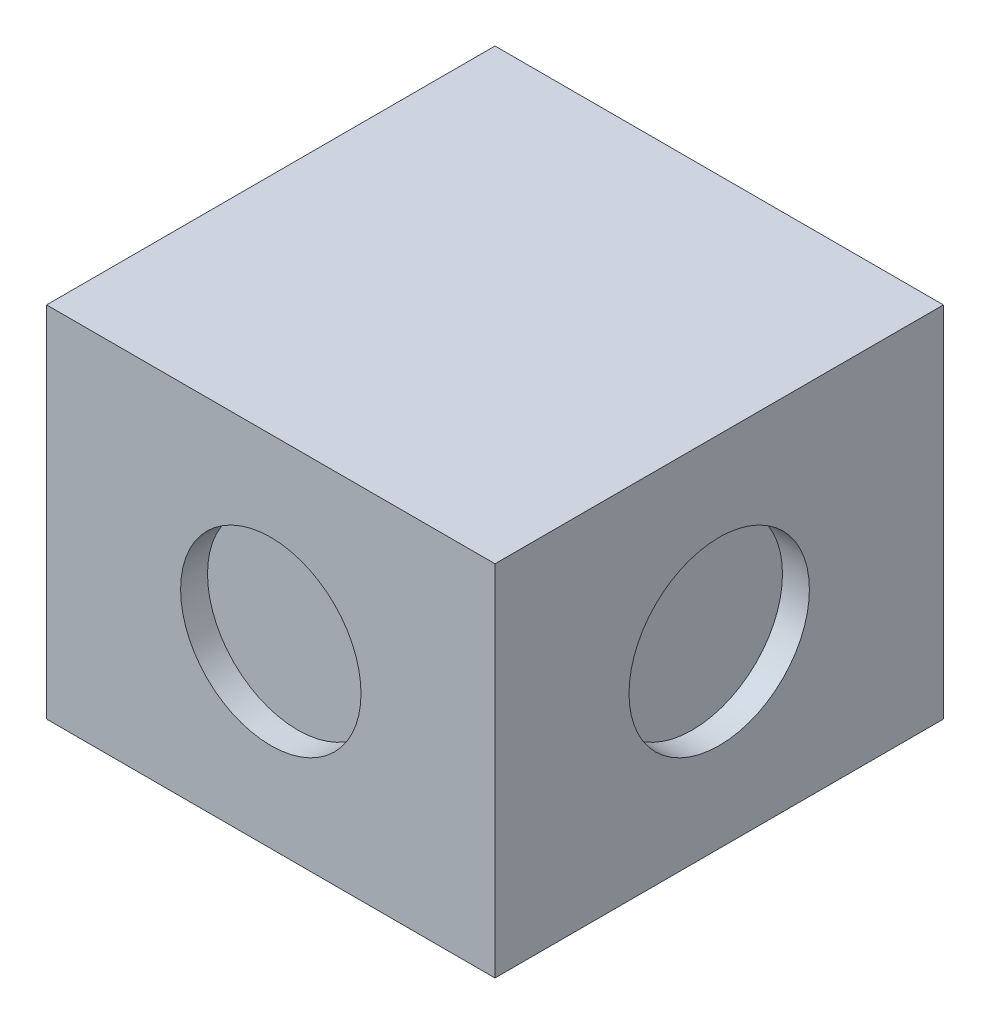
ISO-10303-21;
HEADER;
FILE_DESCRIPTION(('STEP AP214'),'2;1');
FILE_NAME('part.step','',(''),(''),'','','');
FILE_SCHEMA(('AUTOMOTIVE_DESIGN { 1 0 10303 214 1 1 1 1 }'));
ENDSEC;
DATA;
#1=APPLICATION_CONTEXT('core data for automotive mechanical design processes');
#2=APPLICATION_PROTOCOL_DEFINITION('international standard','automotive_design',2000,#1);
#3=PRODUCT_CONTEXT('',#1,'mechanical');
#4=PRODUCT('Part','Part','',(#3));
#5=PRODUCT_RELATED_PRODUCT_CATEGORY('part','',(#4));
#6=PRODUCT_DEFINITION_FORMATION('','',#4);
#7=PRODUCT_DEFINITION_CONTEXT('part definition',#1,'design');
#8=PRODUCT_DEFINITION('design','',#6,#7);
#9=PRODUCT_DEFINITION_SHAPE('','',#8);
#10=(LENGTH_UNIT() NAMED_UNIT(*) SI_UNIT(.MILLI.,.METRE.));
#11=(NAMED_UNIT(*) PLANE_ANGLE_UNIT() SI_UNIT($,.RADIAN.));
#12=(NAMED_UNIT(*) SI_UNIT($,.STERADIAN.) SOLID_ANGLE_UNIT());
#13=UNCERTAINTY_MEASURE_WITH_UNIT(LENGTH_MEASURE(1.E-05),#10,'distance_accuracy_value','');
#14=(GEOMETRIC_REPRESENTATION_CONTEXT(3) GLOBAL_UNCERTAINTY_ASSIGNED_CONTEXT((#13)) GLOBAL_UNIT_ASSIGNED_CONTEXT((#10,
#11,#12)) REPRESENTATION_CONTEXT('',''));
#15=CARTESIAN_POINT('',(0.,0.,0.));
#16=DIRECTION('',(0.,0.,1.));
#17=DIRECTION('',(1.,0.,0.));
#18=AXIS2_PLACEMENT_3D('',#15,#16,#17);
#19=CARTESIAN_POINT('',(25.,40.,25.));
#20=DIRECTION('',(-1.,0.,0.));
#21=DIRECTION('',(0.,0.,1.));
#22=AXIS2_PLACEMENT_3D('',#19,#20,#21);
#23=PLANE('',#22);
#24=CARTESIAN_POINT('',(25.,20.,0.));
#25=DIRECTION('',(1.,0.,0.));
#26=DIRECTION('',(0.,0.,-1.));
#27=AXIS2_PLACEMENT_3D('',#24,#25,#26);
#28=CIRCLE('',#27,10.057084534);
#29=CARTESIAN_POINT('',(25.,20.,-10.057084534));
#30=VERTEX_POINT('',#29);
#31=EDGE_CURVE('E114',#30,#30,#28,.T.);
#32=ORIENTED_EDGE('',*,*,#31,.F.);
#33=EDGE_LOOP('',(#32));
#34=FACE_BOUND('',#33,.T.);
#35=DIRECTION('',(0.,0.,-1.));
#36=VECTOR('',#35,1.);
#37=CARTESIAN_POINT('',(25.,0.,25.));
#38=LINE('',#37,#36);
#39=CARTESIAN_POINT('',(25.,0.,25.));
#40=VERTEX_POINT('',#39);
#41=CARTESIAN_POINT('',(25.,0.,-25.));
#42=VERTEX_POINT('',#41);
#43=EDGE_CURVE('E100',#40,#42,#38,.T.);
#44=ORIENTED_EDGE('',*,*,#43,.T.);
#45=DIRECTION('',(0.,-1.,0.));
#46=VECTOR('',#45,1.);
#47=CARTESIAN_POINT('',(25.,40.,-25.));
#48=LINE('',#47,#46);
#49=CARTESIAN_POINT('',(25.,40.,-25.));
#50=VERTEX_POINT('',#49);
#51=EDGE_CURVE('E11',#50,#42,#48,.T.);
#52=ORIENTED_EDGE('',*,*,#51,.F.);
#53=DIRECTION('',(0.,0.,-1.));
#54=VECTOR('',#53,1.);
#55=CARTESIAN_POINT('',(25.,40.,25.));
#56=LINE('',#55,#54);
#57=CARTESIAN_POINT('',(25.,40.,25.));
#58=VERTEX_POINT('',#57);
#59=EDGE_CURVE('E88',#58,#50,#56,.T.);
#60=ORIENTED_EDGE('',*,*,#59,.F.);
#61=DIRECTION('',(0.,-1.,0.));
#62=VECTOR('',#61,1.);
#63=CARTESIAN_POINT('',(25.,40.,25.));
#64=LINE('',#63,#62);
#65=EDGE_CURVE('E96',#58,#40,#64,.T.);
#66=ORIENTED_EDGE('',*,*,#65,.T.);
#67=EDGE_LOOP('',(#44,#52,#60,#66));
#68=FACE_BOUND('',#67,.T.);
#69=ADVANCED_FACE('F37',(#34,#68),#23,.F.);
#70=CARTESIAN_POINT('',(-25.,40.,-25.));
#71=DIRECTION('',(0.,0.,1.));
#72=DIRECTION('',(1.,0.,0.));
#73=AXIS2_PLACEMENT_3D('',#70,#71,#72);
#74=PLANE('',#73);
#75=DIRECTION('',(-1.,0.,0.));
#76=VECTOR('',#75,1.);
#77=CARTESIAN_POINT('',(-25.,0.,-25.));
#78=LINE('',#77,#76);
#79=CARTESIAN_POINT('',(-25.,0.,-25.));
#80=VERTEX_POINT('',#79);
#81=EDGE_CURVE('E92',#42,#80,#78,.T.);
#82=ORIENTED_EDGE('',*,*,#81,.T.);
#83=DIRECTION('',(0.,-1.,0.));
#84=VECTOR('',#83,1.);
#85=CARTESIAN_POINT('',(-25.,40.,-25.));
#86=LINE('',#85,#84);
#87=CARTESIAN_POINT('',(-25.,40.,-25.));
#88=VERTEX_POINT('',#87);
#89=EDGE_CURVE('E45',#88,#80,#86,.T.);
#90=ORIENTED_EDGE('',*,*,#89,.F.);
#91=DIRECTION('',(-1.,0.,0.));
#92=VECTOR('',#91,1.);
#93=CARTESIAN_POINT('',(-25.,40.,-25.));
#94=LINE('',#93,#92);
#95=EDGE_CURVE('E83',#50,#88,#94,.T.);
#96=ORIENTED_EDGE('',*,*,#95,.F.);
#97=ORIENTED_EDGE('',*,*,#51,.T.);
#98=EDGE_LOOP('',(#82,#90,#96,#97));
#99=FACE_BOUND('',#98,.T.);
#100=ADVANCED_FACE('F91',(#99),#74,.F.);
#101=CARTESIAN_POINT('',(-25.,40.,25.));
#102=DIRECTION('',(1.,0.,0.));
#103=DIRECTION('',(0.,0.,-1.));
#104=AXIS2_PLACEMENT_3D('',#101,#102,#103);
#105=PLANE('',#104);
#106=DIRECTION('',(0.,0.,1.));
#107=VECTOR('',#106,1.);
#108=CARTESIAN_POINT('',(-25.,0.,25.));
#109=LINE('',#108,#107);
#110=CARTESIAN_POINT('',(-25.,0.,25.));
#111=VERTEX_POINT('',#110);
#112=EDGE_CURVE('E70',#80,#111,#109,.T.);
#113=ORIENTED_EDGE('',*,*,#112,.T.);
#114=DIRECTION('',(0.,-1.,0.));
#115=VECTOR('',#114,1.);
#116=CARTESIAN_POINT('',(-25.,40.,25.));
#117=LINE('',#116,#115);
#118=CARTESIAN_POINT('',(-25.,40.,25.));
#119=VERTEX_POINT('',#118);
#120=EDGE_CURVE('E93',#119,#111,#117,.T.);
#121=ORIENTED_EDGE('',*,*,#120,.F.);
#122=DIRECTION('',(0.,0.,1.));
#123=VECTOR('',#122,1.);
#124=CARTESIAN_POINT('',(-25.,40.,25.));
#125=LINE('',#124,#123);
#126=EDGE_CURVE('E86',#88,#119,#125,.T.);
#127=ORIENTED_EDGE('',*,*,#126,.F.);
#128=ORIENTED_EDGE('',*,*,#89,.T.);
#129=EDGE_LOOP('',(#113,#121,#127,#128));
#130=FACE_BOUND('',#129,.T.);
#131=ADVANCED_FACE('F94',(#130),#105,.F.);
#132=CARTESIAN_POINT('',(-25.,40.,25.));
#133=DIRECTION('',(0.,0.,-1.));
#134=DIRECTION('',(-1.,0.,0.));
#135=AXIS2_PLACEMENT_3D('',#132,#133,#134);
#136=PLANE('',#135);
#137=CARTESIAN_POINT('',(0.,20.,25.));
#138=DIRECTION('',(0.,0.,1.));
#139=DIRECTION('',(1.,0.,0.));
#140=AXIS2_PLACEMENT_3D('',#137,#138,#139);
#141=CIRCLE('',#140,10.057084534);
#142=CARTESIAN_POINT('',(10.057084534,20.,25.));
#143=VERTEX_POINT('',#142);
#144=EDGE_CURVE('E120',#143,#143,#141,.T.);
#145=ORIENTED_EDGE('',*,*,#144,.F.);
#146=EDGE_LOOP('',(#145));
#147=FACE_BOUND('',#146,.T.);
#148=DIRECTION('',(1.,0.,0.));
#149=VECTOR('',#148,1.);
#150=CARTESIAN_POINT('',(-25.,0.,25.));
#151=LINE('',#150,#149);
#152=EDGE_CURVE('E76',#111,#40,#151,.T.);
#153=ORIENTED_EDGE('',*,*,#152,.T.);
#154=ORIENTED_EDGE('',*,*,#65,.F.);
#155=DIRECTION('',(1.,0.,0.));
#156=VECTOR('',#155,1.);
#157=CARTESIAN_POINT('',(-25.,40.,25.));
#158=LINE('',#157,#156);
#159=EDGE_CURVE('E53',#119,#58,#158,.T.);
#160=ORIENTED_EDGE('',*,*,#159,.F.);
#161=ORIENTED_EDGE('',*,*,#120,.T.);
#162=EDGE_LOOP('',(#153,#154,#160,#161));
#163=FACE_BOUND('',#162,.T.);
#164=ADVANCED_FACE('F108',(#147,#163),#136,.F.);
#165=CARTESIAN_POINT('',(0.,40.,0.));
#166=DIRECTION('',(0.,-1.,0.));
#167=DIRECTION('',(0.,0.,-1.));
#168=AXIS2_PLACEMENT_3D('',#165,#166,#167);
#169=PLANE('',#168);
#170=ORIENTED_EDGE('',*,*,#59,.T.);
#171=ORIENTED_EDGE('',*,*,#95,.T.);
#172=ORIENTED_EDGE('',*,*,#126,.T.);
#173=ORIENTED_EDGE('',*,*,#159,.T.);
#174=EDGE_LOOP('',(#170,#171,#172,#173));
#175=FACE_BOUND('',#174,.T.);
#176=ADVANCED_FACE('F84',(#175),#169,.F.);
#177=CARTESIAN_POINT('',(0.,0.,0.));
#178=DIRECTION('',(0.,-1.,0.));
#179=DIRECTION('',(0.,0.,-1.));
#180=AXIS2_PLACEMENT_3D('',#177,#178,#179);
#181=PLANE('',#180);
#182=CARTESIAN_POINT('',(0.,0.,0.));
#183=DIRECTION('',(0.,-1.,0.));
#184=DIRECTION('',(0.,0.,-1.));
#185=AXIS2_PLACEMENT_3D('',#182,#183,#184);
#186=CIRCLE('',#185,17.);
#187=CARTESIAN_POINT('',(0.,0.,-17.));
#188=VERTEX_POINT('',#187);
#189=EDGE_CURVE('E126',#188,#188,#186,.T.);
#190=ORIENTED_EDGE('',*,*,#189,.F.);
#191=EDGE_LOOP('',(#190));
#192=FACE_BOUND('',#191,.T.);
#193=ORIENTED_EDGE('',*,*,#43,.F.);
#194=ORIENTED_EDGE('',*,*,#152,.F.);
#195=ORIENTED_EDGE('',*,*,#112,.F.);
#196=ORIENTED_EDGE('',*,*,#81,.F.);
#197=EDGE_LOOP('',(#193,#194,#195,#196));
#198=FACE_BOUND('',#197,.T.);
#199=ADVANCED_FACE('F111',(#192,#198),#181,.T.);
#200=CARTESIAN_POINT('',(22.,20.,0.));
#201=DIRECTION('',(1.,0.,0.));
#202=DIRECTION('',(0.,0.,-1.));
#203=AXIS2_PLACEMENT_3D('',#200,#201,#202);
#204=CYLINDRICAL_SURFACE('',#203,10.057084534);
#205=CARTESIAN_POINT('',(22.,20.,0.));
#206=DIRECTION('',(1.,0.,0.));
#207=DIRECTION('',(0.,0.,-1.));
#208=AXIS2_PLACEMENT_3D('',#205,#206,#207);
#209=CIRCLE('',#208,10.057084534);
#210=CARTESIAN_POINT('',(22.,20.,-10.057084534));
#211=VERTEX_POINT('',#210);
#212=EDGE_CURVE('E103',#211,#211,#209,.T.);
#213=ORIENTED_EDGE('',*,*,#212,.F.);
#214=EDGE_LOOP('',(#213));
#215=FACE_BOUND('',#214,.T.);
#216=ORIENTED_EDGE('',*,*,#31,.T.);
#217=EDGE_LOOP('',(#216));
#218=FACE_BOUND('',#217,.T.);
#219=ADVANCED_FACE('F142',(#215,#218),#204,.F.);
#220=CARTESIAN_POINT('',(22.,20.,0.));
#221=DIRECTION('',(1.,0.,0.));
#222=DIRECTION('',(0.,0.,-1.));
#223=AXIS2_PLACEMENT_3D('',#220,#221,#222);
#224=PLANE('',#223);
#225=ORIENTED_EDGE('',*,*,#212,.T.);
#226=EDGE_LOOP('',(#225));
#227=FACE_BOUND('',#226,.T.);
#228=ADVANCED_FACE('F148',(#227),#224,.T.);
#229=CARTESIAN_POINT('',(0.,20.,22.));
#230=DIRECTION('',(0.,0.,1.));
#231=DIRECTION('',(1.,0.,0.));
#232=AXIS2_PLACEMENT_3D('',#229,#230,#231);
#233=CYLINDRICAL_SURFACE('',#232,10.057084534);
#234=CARTESIAN_POINT('',(0.,20.,22.));
#235=DIRECTION('',(0.,0.,1.));
#236=DIRECTION('',(1.,0.,0.));
#237=AXIS2_PLACEMENT_3D('',#234,#235,#236);
#238=CIRCLE('',#237,10.057084534);
#239=CARTESIAN_POINT('',(10.057084534,20.,22.));
#240=VERTEX_POINT('',#239);
#241=EDGE_CURVE('E117',#240,#240,#238,.T.);
#242=ORIENTED_EDGE('',*,*,#241,.F.);
#243=EDGE_LOOP('',(#242));
#244=FACE_BOUND('',#243,.T.);
#245=ORIENTED_EDGE('',*,*,#144,.T.);
#246=EDGE_LOOP('',(#245));
#247=FACE_BOUND('',#246,.T.);
#248=ADVANCED_FACE('F170',(#244,#247),#233,.F.);
#249=CARTESIAN_POINT('',(0.,20.,22.));
#250=DIRECTION('',(0.,0.,1.));
#251=DIRECTION('',(1.,0.,0.));
#252=AXIS2_PLACEMENT_3D('',#249,#250,#251);
#253=PLANE('',#252);
#254=ORIENTED_EDGE('',*,*,#241,.T.);
#255=EDGE_LOOP('',(#254));
#256=FACE_BOUND('',#255,.T.);
#257=ADVANCED_FACE('F137',(#256),#253,.T.);
#258=CARTESIAN_POINT('',(0.,3.,0.));
#259=DIRECTION('',(0.,-1.,0.));
#260=DIRECTION('',(0.,0.,-1.));
#261=AXIS2_PLACEMENT_3D('',#258,#259,#260);
#262=CYLINDRICAL_SURFACE('',#261,17.);
#263=CARTESIAN_POINT('',(0.,3.,0.));
#264=DIRECTION('',(0.,-1.,0.));
#265=DIRECTION('',(0.,0.,-1.));
#266=AXIS2_PLACEMENT_3D('',#263,#264,#265);
#267=CIRCLE('',#266,17.);
#268=CARTESIAN_POINT('',(0.,3.,-17.));
#269=VERTEX_POINT('',#268);
#270=EDGE_CURVE('E123',#269,#269,#267,.T.);
#271=ORIENTED_EDGE('',*,*,#270,.F.);
#272=EDGE_LOOP('',(#271));
#273=FACE_BOUND('',#272,.T.);
#274=ORIENTED_EDGE('',*,*,#189,.T.);
#275=EDGE_LOOP('',(#274));
#276=FACE_BOUND('',#275,.T.);
#277=ADVANCED_FACE('F134',(#273,#276),#262,.F.);
#278=CARTESIAN_POINT('',(0.,3.,0.));
#279=DIRECTION('',(0.,-1.,0.));
#280=DIRECTION('',(0.,0.,-1.));
#281=AXIS2_PLACEMENT_3D('',#278,#279,#280);
#282=PLANE('',#281);
#283=ORIENTED_EDGE('',*,*,#270,.T.);
#284=EDGE_LOOP('',(#283));
#285=FACE_BOUND('',#284,.T.);
#286=ADVANCED_FACE('F132',(#285),#282,.T.);
#287=CLOSED_SHELL('',(#69,#100,#131,#164,#176,#199,#219,#228,#248,#257,#277,#286));
#288=MANIFOLD_SOLID_BREP('B2',#287);
#289=ADVANCED_BREP_SHAPE_REPRESENTATION('',(#18,#288),#14);
#290=SHAPE_DEFINITION_REPRESENTATION(#9,#289);
ENDSEC;
END-ISO-10303-21;
